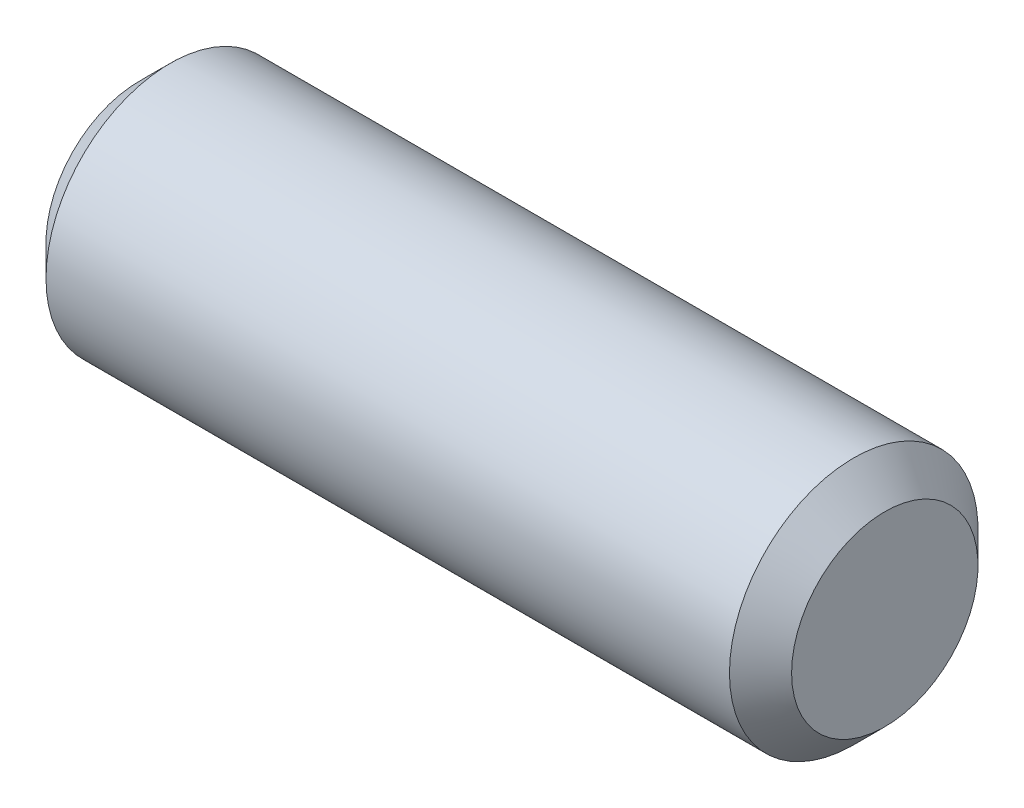
ISO-10303-21;
HEADER;
FILE_DESCRIPTION(('STEP AP214'),'2;1');
FILE_NAME('part.step','',(''),(''),'','','');
FILE_SCHEMA(('AUTOMOTIVE_DESIGN { 1 0 10303 214 1 1 1 1 }'));
ENDSEC;
DATA;
#1=APPLICATION_CONTEXT('core data for automotive mechanical design processes');
#2=APPLICATION_PROTOCOL_DEFINITION('international standard','automotive_design',2000,#1);
#3=PRODUCT_CONTEXT('',#1,'mechanical');
#4=PRODUCT('Part','Part','',(#3));
#5=PRODUCT_RELATED_PRODUCT_CATEGORY('part','',(#4));
#6=PRODUCT_DEFINITION_FORMATION('','',#4);
#7=PRODUCT_DEFINITION_CONTEXT('part definition',#1,'design');
#8=PRODUCT_DEFINITION('design','',#6,#7);
#9=PRODUCT_DEFINITION_SHAPE('','',#8);
#10=(LENGTH_UNIT() NAMED_UNIT(*) SI_UNIT(.MILLI.,.METRE.));
#11=(NAMED_UNIT(*) PLANE_ANGLE_UNIT() SI_UNIT($,.RADIAN.));
#12=(NAMED_UNIT(*) SI_UNIT($,.STERADIAN.) SOLID_ANGLE_UNIT());
#13=UNCERTAINTY_MEASURE_WITH_UNIT(LENGTH_MEASURE(1.E-05),#10,'distance_accuracy_value','');
#14=(GEOMETRIC_REPRESENTATION_CONTEXT(3) GLOBAL_UNCERTAINTY_ASSIGNED_CONTEXT((#13)) GLOBAL_UNIT_ASSIGNED_CONTEXT((#10,
#11,#12)) REPRESENTATION_CONTEXT('',''));
#15=CARTESIAN_POINT('',(0.,0.,0.));
#16=DIRECTION('',(0.,0.,1.));
#17=DIRECTION('',(1.,0.,0.));
#18=AXIS2_PLACEMENT_3D('',#15,#16,#17);
#19=CARTESIAN_POINT('',(6.,0.,0.));
#20=DIRECTION('',(-1.,0.,0.));
#21=DIRECTION('',(0.,0.,1.));
#22=AXIS2_PLACEMENT_3D('',#19,#20,#21);
#23=PLANE('',#22);
#24=CARTESIAN_POINT('',(5.99999999997181,0.,0.));
#25=DIRECTION('',(-1.,0.,0.));
#26=DIRECTION('',(0.,0.,1.));
#27=AXIS2_PLACEMENT_3D('',#24,#25,#26);
#28=CIRCLE('',#27,0.749999999925421);
#29=CARTESIAN_POINT('',(5.99999999997181,0.,0.749999999925421));
#30=VERTEX_POINT('',#29);
#31=EDGE_CURVE('E17',#30,#30,#28,.T.);
#32=ORIENTED_EDGE('',*,*,#31,.F.);
#33=EDGE_LOOP('',(#32));
#34=FACE_BOUND('',#33,.T.);
#35=ADVANCED_FACE('F14',(#34),#23,.F.);
#36=CARTESIAN_POINT('',(0.,0.,0.));
#37=DIRECTION('',(1.,0.,0.));
#38=DIRECTION('',(0.,0.,-1.));
#39=AXIS2_PLACEMENT_3D('',#36,#37,#38);
#40=PLANE('',#39);
#41=CARTESIAN_POINT('',(0.,0.,0.));
#42=DIRECTION('',(1.,0.,0.));
#43=DIRECTION('',(0.,0.,-1.));
#44=AXIS2_PLACEMENT_3D('',#41,#42,#43);
#45=CIRCLE('',#44,0.749999999925421);
#46=CARTESIAN_POINT('',(0.,0.,-0.749999999925421));
#47=VERTEX_POINT('',#46);
#48=EDGE_CURVE('E26',#47,#47,#45,.T.);
#49=ORIENTED_EDGE('',*,*,#48,.F.);
#50=EDGE_LOOP('',(#49));
#51=FACE_BOUND('',#50,.T.);
#52=ADVANCED_FACE('F37',(#51),#40,.F.);
#53=CARTESIAN_POINT('',(5.74999999992087,0.,0.));
#54=DIRECTION('',(-1.,0.,0.));
#55=DIRECTION('',(0.,0.,1.));
#56=AXIS2_PLACEMENT_3D('',#53,#54,#55);
#57=CONICAL_SURFACE('',#56,1.0000000000332,0.785398163511135);
#58=CARTESIAN_POINT('',(5.75,0.,0.));
#59=DIRECTION('',(-1.,0.,0.));
#60=DIRECTION('',(0.,0.,1.));
#61=AXIS2_PLACEMENT_3D('',#58,#59,#60);
#62=CIRCLE('',#61,1.);
#63=CARTESIAN_POINT('',(5.75,0.,1.));
#64=VERTEX_POINT('',#63);
#65=EDGE_CURVE('E21',#64,#64,#62,.T.);
#66=ORIENTED_EDGE('',*,*,#65,.F.);
#67=EDGE_LOOP('',(#66));
#68=FACE_BOUND('',#67,.T.);
#69=ORIENTED_EDGE('',*,*,#31,.T.);
#70=EDGE_LOOP('',(#69));
#71=FACE_BOUND('',#70,.T.);
#72=ADVANCED_FACE('F34',(#68,#71),#57,.T.);
#73=CARTESIAN_POINT('',(0.250000000107775,0.,0.));
#74=DIRECTION('',(1.,0.,0.));
#75=DIRECTION('',(0.,0.,-1.));
#76=AXIS2_PLACEMENT_3D('',#73,#74,#75);
#77=CONICAL_SURFACE('',#76,1.00000000009004,0.785398163511135);
#78=CARTESIAN_POINT('',(0.250000000000001,0.,0.));
#79=DIRECTION('',(-1.,0.,0.));
#80=DIRECTION('',(0.,0.,1.));
#81=AXIS2_PLACEMENT_3D('',#78,#79,#80);
#82=CIRCLE('',#81,1.);
#83=CARTESIAN_POINT('',(0.250000000000001,0.,1.));
#84=VERTEX_POINT('',#83);
#85=EDGE_CURVE('E10',#84,#84,#82,.F.);
#86=ORIENTED_EDGE('',*,*,#85,.F.);
#87=EDGE_LOOP('',(#86));
#88=FACE_BOUND('',#87,.T.);
#89=ORIENTED_EDGE('',*,*,#48,.T.);
#90=EDGE_LOOP('',(#89));
#91=FACE_BOUND('',#90,.T.);
#92=ADVANCED_FACE('F45',(#88,#91),#77,.T.);
#93=CARTESIAN_POINT('',(0.,0.,0.));
#94=DIRECTION('',(-1.,0.,0.));
#95=DIRECTION('',(0.,0.,1.));
#96=AXIS2_PLACEMENT_3D('',#93,#94,#95);
#97=CYLINDRICAL_SURFACE('',#96,1.);
#98=ORIENTED_EDGE('',*,*,#85,.T.);
#99=EDGE_LOOP('',(#98));
#100=FACE_BOUND('',#99,.T.);
#101=ORIENTED_EDGE('',*,*,#65,.T.);
#102=EDGE_LOOP('',(#101));
#103=FACE_BOUND('',#102,.T.);
#104=ADVANCED_FACE('F43',(#100,#103),#97,.T.);
#105=CLOSED_SHELL('',(#35,#52,#72,#92,#104));
#106=MANIFOLD_SOLID_BREP('B1',#105);
#107=ADVANCED_BREP_SHAPE_REPRESENTATION('',(#18,#106),#14);
#108=SHAPE_DEFINITION_REPRESENTATION(#9,#107);
ENDSEC;
END-ISO-10303-21;
